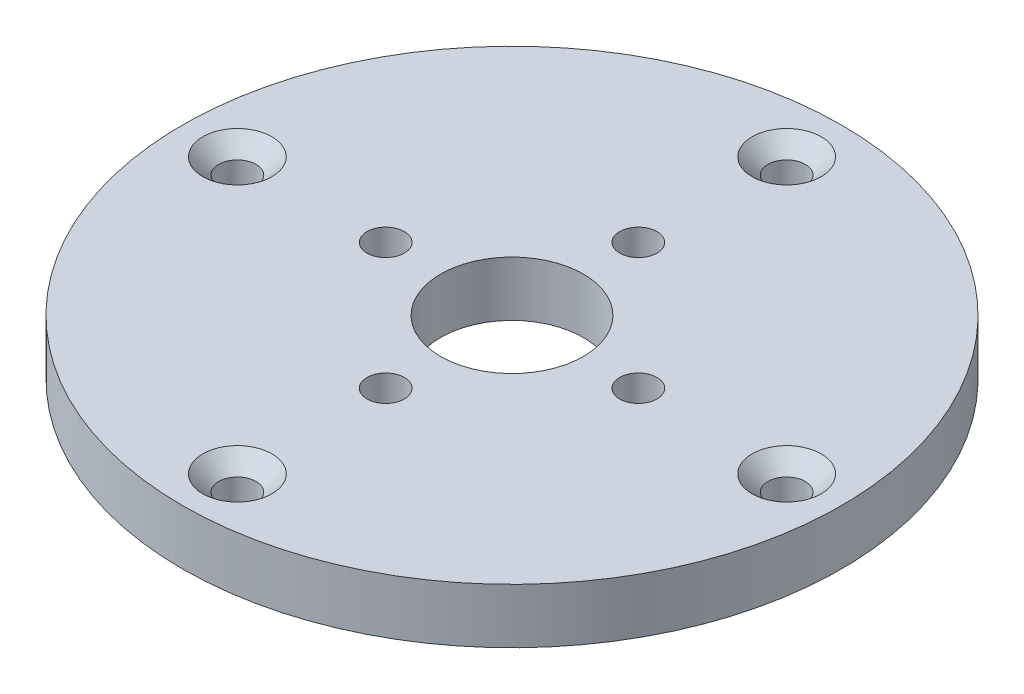
ISO-10303-21;
HEADER;
FILE_DESCRIPTION(('STEP AP214'),'2;1');
FILE_NAME('part.step','',(''),(''),'','','');
FILE_SCHEMA(('AUTOMOTIVE_DESIGN { 1 0 10303 214 1 1 1 1 }'));
ENDSEC;
DATA;
#1=APPLICATION_CONTEXT('core data for automotive mechanical design processes');
#2=APPLICATION_PROTOCOL_DEFINITION('international standard','automotive_design',2000,#1);
#3=PRODUCT_CONTEXT('',#1,'mechanical');
#4=PRODUCT('Part','Part','',(#3));
#5=PRODUCT_RELATED_PRODUCT_CATEGORY('part','',(#4));
#6=PRODUCT_DEFINITION_FORMATION('','',#4);
#7=PRODUCT_DEFINITION_CONTEXT('part definition',#1,'design');
#8=PRODUCT_DEFINITION('design','',#6,#7);
#9=PRODUCT_DEFINITION_SHAPE('','',#8);
#10=(LENGTH_UNIT() NAMED_UNIT(*) SI_UNIT(.MILLI.,.METRE.));
#11=(NAMED_UNIT(*) PLANE_ANGLE_UNIT() SI_UNIT($,.RADIAN.));
#12=(NAMED_UNIT(*) SI_UNIT($,.STERADIAN.) SOLID_ANGLE_UNIT());
#13=UNCERTAINTY_MEASURE_WITH_UNIT(LENGTH_MEASURE(1.E-05),#10,'distance_accuracy_value','');
#14=(GEOMETRIC_REPRESENTATION_CONTEXT(3) GLOBAL_UNCERTAINTY_ASSIGNED_CONTEXT((#13)) GLOBAL_UNIT_ASSIGNED_CONTEXT((#10,
#11,#12)) REPRESENTATION_CONTEXT('',''));
#15=CARTESIAN_POINT('',(0.,0.,0.));
#16=DIRECTION('',(0.,0.,1.));
#17=DIRECTION('',(1.,0.,0.));
#18=AXIS2_PLACEMENT_3D('',#15,#16,#17);
#19=CARTESIAN_POINT('',(0.,0.,0.));
#20=DIRECTION('',(0.,1.,0.));
#21=DIRECTION('',(0.,0.,1.));
#22=AXIS2_PLACEMENT_3D('',#19,#20,#21);
#23=PLANE('',#22);
#24=CARTESIAN_POINT('',(0.,0.,-25.));
#25=DIRECTION('',(0.,1.,0.));
#26=DIRECTION('',(0.,0.,1.));
#27=AXIS2_PLACEMENT_3D('',#24,#25,#26);
#28=CIRCLE('',#27,1.69999999999999);
#29=CARTESIAN_POINT('',(0.,0.,-23.3));
#30=VERTEX_POINT('',#29);
#31=EDGE_CURVE('E79',#30,#30,#28,.T.);
#32=ORIENTED_EDGE('',*,*,#31,.T.);
#33=EDGE_LOOP('',(#32));
#34=FACE_BOUND('',#33,.T.);
#35=CARTESIAN_POINT('',(-25.,0.,0.));
#36=DIRECTION('',(0.,1.,0.));
#37=DIRECTION('',(0.,0.,1.));
#38=AXIS2_PLACEMENT_3D('',#35,#36,#37);
#39=CIRCLE('',#38,1.69999999999999);
#40=CARTESIAN_POINT('',(-25.,0.,1.69999999999999));
#41=VERTEX_POINT('',#40);
#42=EDGE_CURVE('E70',#41,#41,#39,.T.);
#43=ORIENTED_EDGE('',*,*,#42,.T.);
#44=EDGE_LOOP('',(#43));
#45=FACE_BOUND('',#44,.T.);
#46=CARTESIAN_POINT('',(0.,0.,25.));
#47=DIRECTION('',(0.,1.,0.));
#48=DIRECTION('',(0.,0.,1.));
#49=AXIS2_PLACEMENT_3D('',#46,#47,#48);
#50=CIRCLE('',#49,1.69999999999999);
#51=CARTESIAN_POINT('',(0.,0.,26.7));
#52=VERTEX_POINT('',#51);
#53=EDGE_CURVE('E61',#52,#52,#50,.T.);
#54=ORIENTED_EDGE('',*,*,#53,.T.);
#55=EDGE_LOOP('',(#54));
#56=FACE_BOUND('',#55,.T.);
#57=CARTESIAN_POINT('',(25.,0.,0.));
#58=DIRECTION('',(0.,1.,0.));
#59=DIRECTION('',(0.,0.,1.));
#60=AXIS2_PLACEMENT_3D('',#57,#58,#59);
#61=CIRCLE('',#60,1.69999999999999);
#62=CARTESIAN_POINT('',(25.,0.,1.69999999999999));
#63=VERTEX_POINT('',#62);
#64=EDGE_CURVE('E50',#63,#63,#61,.T.);
#65=ORIENTED_EDGE('',*,*,#64,.T.);
#66=EDGE_LOOP('',(#65));
#67=FACE_BOUND('',#66,.T.);
#68=CARTESIAN_POINT('',(0.,0.,0.));
#69=DIRECTION('',(0.,1.,0.));
#70=DIRECTION('',(0.,0.,1.));
#71=AXIS2_PLACEMENT_3D('',#68,#69,#70);
#72=CIRCLE('',#71,30.);
#73=CARTESIAN_POINT('',(0.,0.,30.));
#74=VERTEX_POINT('',#73);
#75=EDGE_CURVE('E38',#74,#74,#72,.T.);
#76=ORIENTED_EDGE('',*,*,#75,.F.);
#77=EDGE_LOOP('',(#76));
#78=FACE_BOUND('',#77,.T.);
#79=CARTESIAN_POINT('',(0.,0.,0.));
#80=DIRECTION('',(0.,1.,0.));
#81=DIRECTION('',(0.,0.,1.));
#82=AXIS2_PLACEMENT_3D('',#79,#80,#81);
#83=CIRCLE('',#82,6.5);
#84=CARTESIAN_POINT('',(0.,0.,6.5));
#85=VERTEX_POINT('',#84);
#86=EDGE_CURVE('E47',#85,#85,#83,.T.);
#87=ORIENTED_EDGE('',*,*,#86,.T.);
#88=EDGE_LOOP('',(#87));
#89=FACE_BOUND('',#88,.T.);
#90=CARTESIAN_POINT('',(-11.5,0.,0.));
#91=DIRECTION('',(0.,-1.,0.));
#92=DIRECTION('',(0.,0.,-1.));
#93=AXIS2_PLACEMENT_3D('',#90,#91,#92);
#94=CIRCLE('',#93,3.15);
#95=CARTESIAN_POINT('',(-11.5,0.,-3.15));
#96=VERTEX_POINT('',#95);
#97=EDGE_CURVE('E94',#96,#96,#94,.T.);
#98=ORIENTED_EDGE('',*,*,#97,.F.);
#99=EDGE_LOOP('',(#98));
#100=FACE_BOUND('',#99,.T.);
#101=CARTESIAN_POINT('',(0.,0.,11.5));
#102=DIRECTION('',(0.,-1.,0.));
#103=DIRECTION('',(0.,0.,-1.));
#104=AXIS2_PLACEMENT_3D('',#101,#102,#103);
#105=CIRCLE('',#104,3.15);
#106=CARTESIAN_POINT('',(0.,0.,8.35));
#107=VERTEX_POINT('',#106);
#108=EDGE_CURVE('E103',#107,#107,#105,.T.);
#109=ORIENTED_EDGE('',*,*,#108,.F.);
#110=EDGE_LOOP('',(#109));
#111=FACE_BOUND('',#110,.T.);
#112=CARTESIAN_POINT('',(11.5,0.,0.));
#113=DIRECTION('',(0.,-1.,0.));
#114=DIRECTION('',(0.,0.,-1.));
#115=AXIS2_PLACEMENT_3D('',#112,#113,#114);
#116=CIRCLE('',#115,3.15);
#117=CARTESIAN_POINT('',(11.5,0.,-3.15));
#118=VERTEX_POINT('',#117);
#119=EDGE_CURVE('E112',#118,#118,#116,.T.);
#120=ORIENTED_EDGE('',*,*,#119,.F.);
#121=EDGE_LOOP('',(#120));
#122=FACE_BOUND('',#121,.T.);
#123=CARTESIAN_POINT('',(0.,0.,-11.5));
#124=DIRECTION('',(0.,-1.,0.));
#125=DIRECTION('',(0.,0.,-1.));
#126=AXIS2_PLACEMENT_3D('',#123,#124,#125);
#127=CIRCLE('',#126,3.15);
#128=CARTESIAN_POINT('',(0.,0.,-14.65));
#129=VERTEX_POINT('',#128);
#130=EDGE_CURVE('E121',#129,#129,#127,.T.);
#131=ORIENTED_EDGE('',*,*,#130,.F.);
#132=EDGE_LOOP('',(#131));
#133=FACE_BOUND('',#132,.T.);
#134=ADVANCED_FACE('F34',(#34,#45,#56,#67,#78,#89,#100,#111,#122,#133),#23,.F.);
#135=CARTESIAN_POINT('',(0.,5.,0.));
#136=DIRECTION('',(0.,1.,0.));
#137=DIRECTION('',(0.,0.,1.));
#138=AXIS2_PLACEMENT_3D('',#135,#136,#137);
#139=PLANE('',#138);
#140=CARTESIAN_POINT('',(0.,5.,-11.5));
#141=DIRECTION('',(0.,1.,0.));
#142=DIRECTION('',(0.,0.,1.));
#143=AXIS2_PLACEMENT_3D('',#140,#141,#142);
#144=CIRCLE('',#143,1.69999999999999);
#145=CARTESIAN_POINT('',(0.,5.,-9.80000000000001));
#146=VERTEX_POINT('',#145);
#147=EDGE_CURVE('E115',#146,#146,#144,.T.);
#148=ORIENTED_EDGE('',*,*,#147,.F.);
#149=EDGE_LOOP('',(#148));
#150=FACE_BOUND('',#149,.T.);
#151=CARTESIAN_POINT('',(11.5,5.,0.));
#152=DIRECTION('',(0.,1.,0.));
#153=DIRECTION('',(0.,0.,1.));
#154=AXIS2_PLACEMENT_3D('',#151,#152,#153);
#155=CIRCLE('',#154,1.69999999999999);
#156=CARTESIAN_POINT('',(11.5,5.,1.69999999999999));
#157=VERTEX_POINT('',#156);
#158=EDGE_CURVE('E106',#157,#157,#155,.T.);
#159=ORIENTED_EDGE('',*,*,#158,.F.);
#160=EDGE_LOOP('',(#159));
#161=FACE_BOUND('',#160,.T.);
#162=CARTESIAN_POINT('',(0.,5.,11.5));
#163=DIRECTION('',(0.,1.,0.));
#164=DIRECTION('',(0.,0.,1.));
#165=AXIS2_PLACEMENT_3D('',#162,#163,#164);
#166=CIRCLE('',#165,1.69999999999999);
#167=CARTESIAN_POINT('',(0.,5.,13.2));
#168=VERTEX_POINT('',#167);
#169=EDGE_CURVE('E97',#168,#168,#166,.T.);
#170=ORIENTED_EDGE('',*,*,#169,.F.);
#171=EDGE_LOOP('',(#170));
#172=FACE_BOUND('',#171,.T.);
#173=CARTESIAN_POINT('',(-11.5,5.,0.));
#174=DIRECTION('',(0.,1.,0.));
#175=DIRECTION('',(0.,0.,1.));
#176=AXIS2_PLACEMENT_3D('',#173,#174,#175);
#177=CIRCLE('',#176,1.69999999999999);
#178=CARTESIAN_POINT('',(-11.5,5.,1.69999999999999));
#179=VERTEX_POINT('',#178);
#180=EDGE_CURVE('E88',#179,#179,#177,.T.);
#181=ORIENTED_EDGE('',*,*,#180,.F.);
#182=EDGE_LOOP('',(#181));
#183=FACE_BOUND('',#182,.T.);
#184=CARTESIAN_POINT('',(0.,5.,-25.));
#185=DIRECTION('',(0.,1.,0.));
#186=DIRECTION('',(0.,0.,1.));
#187=AXIS2_PLACEMENT_3D('',#184,#185,#186);
#188=CIRCLE('',#187,3.15);
#189=CARTESIAN_POINT('',(0.,5.,-21.85));
#190=VERTEX_POINT('',#189);
#191=EDGE_CURVE('E85',#190,#190,#188,.T.);
#192=ORIENTED_EDGE('',*,*,#191,.F.);
#193=EDGE_LOOP('',(#192));
#194=FACE_BOUND('',#193,.T.);
#195=CARTESIAN_POINT('',(-25.,5.,0.));
#196=DIRECTION('',(0.,1.,0.));
#197=DIRECTION('',(0.,0.,1.));
#198=AXIS2_PLACEMENT_3D('',#195,#196,#197);
#199=CIRCLE('',#198,3.15);
#200=CARTESIAN_POINT('',(-25.,5.,3.15));
#201=VERTEX_POINT('',#200);
#202=EDGE_CURVE('E76',#201,#201,#199,.T.);
#203=ORIENTED_EDGE('',*,*,#202,.F.);
#204=EDGE_LOOP('',(#203));
#205=FACE_BOUND('',#204,.T.);
#206=CARTESIAN_POINT('',(0.,5.,25.));
#207=DIRECTION('',(0.,1.,0.));
#208=DIRECTION('',(0.,0.,1.));
#209=AXIS2_PLACEMENT_3D('',#206,#207,#208);
#210=CIRCLE('',#209,3.15);
#211=CARTESIAN_POINT('',(0.,5.,28.15));
#212=VERTEX_POINT('',#211);
#213=EDGE_CURVE('E67',#212,#212,#210,.T.);
#214=ORIENTED_EDGE('',*,*,#213,.F.);
#215=EDGE_LOOP('',(#214));
#216=FACE_BOUND('',#215,.T.);
#217=CARTESIAN_POINT('',(25.,5.,0.));
#218=DIRECTION('',(0.,1.,0.));
#219=DIRECTION('',(0.,0.,1.));
#220=AXIS2_PLACEMENT_3D('',#217,#218,#219);
#221=CIRCLE('',#220,3.15);
#222=CARTESIAN_POINT('',(25.,5.,3.15));
#223=VERTEX_POINT('',#222);
#224=EDGE_CURVE('E58',#223,#223,#221,.T.);
#225=ORIENTED_EDGE('',*,*,#224,.F.);
#226=EDGE_LOOP('',(#225));
#227=FACE_BOUND('',#226,.T.);
#228=CARTESIAN_POINT('',(0.,5.,0.));
#229=DIRECTION('',(0.,1.,0.));
#230=DIRECTION('',(0.,0.,1.));
#231=AXIS2_PLACEMENT_3D('',#228,#229,#230);
#232=CIRCLE('',#231,30.);
#233=CARTESIAN_POINT('',(0.,5.,30.));
#234=VERTEX_POINT('',#233);
#235=EDGE_CURVE('E10',#234,#234,#232,.T.);
#236=ORIENTED_EDGE('',*,*,#235,.T.);
#237=EDGE_LOOP('',(#236));
#238=FACE_BOUND('',#237,.T.);
#239=CARTESIAN_POINT('',(0.,5.,0.));
#240=DIRECTION('',(0.,1.,0.));
#241=DIRECTION('',(0.,0.,1.));
#242=AXIS2_PLACEMENT_3D('',#239,#240,#241);
#243=CIRCLE('',#242,6.5);
#244=CARTESIAN_POINT('',(0.,5.,6.5));
#245=VERTEX_POINT('',#244);
#246=EDGE_CURVE('E45',#245,#245,#243,.T.);
#247=ORIENTED_EDGE('',*,*,#246,.F.);
#248=EDGE_LOOP('',(#247));
#249=FACE_BOUND('',#248,.T.);
#250=ADVANCED_FACE('F128',(#150,#161,#172,#183,#194,#205,#216,#227,#238,#249),#139,.T.);
#251=CARTESIAN_POINT('',(0.,5.,0.));
#252=DIRECTION('',(0.,-1.,0.));
#253=DIRECTION('',(0.,0.,-1.));
#254=AXIS2_PLACEMENT_3D('',#251,#252,#253);
#255=CYLINDRICAL_SURFACE('',#254,30.);
#256=ORIENTED_EDGE('',*,*,#235,.F.);
#257=EDGE_LOOP('',(#256));
#258=FACE_BOUND('',#257,.T.);
#259=ORIENTED_EDGE('',*,*,#75,.T.);
#260=EDGE_LOOP('',(#259));
#261=FACE_BOUND('',#260,.T.);
#262=ADVANCED_FACE('F36',(#258,#261),#255,.T.);
#263=CARTESIAN_POINT('',(0.,5.,0.));
#264=DIRECTION('',(0.,-1.,0.));
#265=DIRECTION('',(0.,0.,-1.));
#266=AXIS2_PLACEMENT_3D('',#263,#264,#265);
#267=CYLINDRICAL_SURFACE('',#266,6.5);
#268=ORIENTED_EDGE('',*,*,#246,.T.);
#269=EDGE_LOOP('',(#268));
#270=FACE_BOUND('',#269,.T.);
#271=ORIENTED_EDGE('',*,*,#86,.F.);
#272=EDGE_LOOP('',(#271));
#273=FACE_BOUND('',#272,.T.);
#274=ADVANCED_FACE('F137',(#270,#273),#267,.F.);
#275=CARTESIAN_POINT('',(25.,5.,0.));
#276=DIRECTION('',(0.,1.,0.));
#277=DIRECTION('',(0.,0.,1.));
#278=AXIS2_PLACEMENT_3D('',#275,#276,#277);
#279=CYLINDRICAL_SURFACE('',#278,1.69999999999999);
#280=ORIENTED_EDGE('',*,*,#64,.F.);
#281=EDGE_LOOP('',(#280));
#282=FACE_BOUND('',#281,.T.);
#283=CARTESIAN_POINT('',(25.,3.54999999999999,0.));
#284=DIRECTION('',(0.,1.,0.));
#285=DIRECTION('',(0.,0.,1.));
#286=AXIS2_PLACEMENT_3D('',#283,#284,#285);
#287=CIRCLE('',#286,1.69999999999999);
#288=CARTESIAN_POINT('',(25.,3.54999999999999,1.69999999999999));
#289=VERTEX_POINT('',#288);
#290=EDGE_CURVE('E55',#289,#289,#287,.T.);
#291=ORIENTED_EDGE('',*,*,#290,.T.);
#292=EDGE_LOOP('',(#291));
#293=FACE_BOUND('',#292,.T.);
#294=ADVANCED_FACE('F140',(#282,#293),#279,.F.);
#295=CARTESIAN_POINT('',(25.,5.,0.));
#296=DIRECTION('',(0.,1.,0.));
#297=DIRECTION('',(0.,0.,1.));
#298=AXIS2_PLACEMENT_3D('',#295,#296,#297);
#299=CONICAL_SURFACE('',#298,3.15,0.785398163397449);
#300=ORIENTED_EDGE('',*,*,#290,.F.);
#301=EDGE_LOOP('',(#300));
#302=FACE_BOUND('',#301,.T.);
#303=ORIENTED_EDGE('',*,*,#224,.T.);
#304=EDGE_LOOP('',(#303));
#305=FACE_BOUND('',#304,.T.);
#306=ADVANCED_FACE('F144',(#302,#305),#299,.F.);
#307=CARTESIAN_POINT('',(0.,5.,25.));
#308=DIRECTION('',(0.,1.,0.));
#309=DIRECTION('',(0.,0.,1.));
#310=AXIS2_PLACEMENT_3D('',#307,#308,#309);
#311=CYLINDRICAL_SURFACE('',#310,1.69999999999999);
#312=ORIENTED_EDGE('',*,*,#53,.F.);
#313=EDGE_LOOP('',(#312));
#314=FACE_BOUND('',#313,.T.);
#315=CARTESIAN_POINT('',(0.,3.54999999999999,25.));
#316=DIRECTION('',(0.,1.,0.));
#317=DIRECTION('',(0.,0.,1.));
#318=AXIS2_PLACEMENT_3D('',#315,#316,#317);
#319=CIRCLE('',#318,1.69999999999999);
#320=CARTESIAN_POINT('',(0.,3.54999999999999,26.7));
#321=VERTEX_POINT('',#320);
#322=EDGE_CURVE('E64',#321,#321,#319,.T.);
#323=ORIENTED_EDGE('',*,*,#322,.T.);
#324=EDGE_LOOP('',(#323));
#325=FACE_BOUND('',#324,.T.);
#326=ADVANCED_FACE('F148',(#314,#325),#311,.F.);
#327=CARTESIAN_POINT('',(0.,5.,25.));
#328=DIRECTION('',(0.,1.,0.));
#329=DIRECTION('',(0.,0.,1.));
#330=AXIS2_PLACEMENT_3D('',#327,#328,#329);
#331=CONICAL_SURFACE('',#330,3.15,0.785398163397449);
#332=ORIENTED_EDGE('',*,*,#322,.F.);
#333=EDGE_LOOP('',(#332));
#334=FACE_BOUND('',#333,.T.);
#335=ORIENTED_EDGE('',*,*,#213,.T.);
#336=EDGE_LOOP('',(#335));
#337=FACE_BOUND('',#336,.T.);
#338=ADVANCED_FACE('F152',(#334,#337),#331,.F.);
#339=CARTESIAN_POINT('',(-25.,5.,0.));
#340=DIRECTION('',(0.,1.,0.));
#341=DIRECTION('',(0.,0.,1.));
#342=AXIS2_PLACEMENT_3D('',#339,#340,#341);
#343=CYLINDRICAL_SURFACE('',#342,1.69999999999999);
#344=ORIENTED_EDGE('',*,*,#42,.F.);
#345=EDGE_LOOP('',(#344));
#346=FACE_BOUND('',#345,.T.);
#347=CARTESIAN_POINT('',(-25.,3.54999999999999,0.));
#348=DIRECTION('',(0.,1.,0.));
#349=DIRECTION('',(0.,0.,1.));
#350=AXIS2_PLACEMENT_3D('',#347,#348,#349);
#351=CIRCLE('',#350,1.69999999999999);
#352=CARTESIAN_POINT('',(-25.,3.54999999999999,1.69999999999999));
#353=VERTEX_POINT('',#352);
#354=EDGE_CURVE('E73',#353,#353,#351,.T.);
#355=ORIENTED_EDGE('',*,*,#354,.T.);
#356=EDGE_LOOP('',(#355));
#357=FACE_BOUND('',#356,.T.);
#358=ADVANCED_FACE('F156',(#346,#357),#343,.F.);
#359=CARTESIAN_POINT('',(-25.,5.,0.));
#360=DIRECTION('',(0.,1.,0.));
#361=DIRECTION('',(0.,0.,1.));
#362=AXIS2_PLACEMENT_3D('',#359,#360,#361);
#363=CONICAL_SURFACE('',#362,3.15,0.785398163397449);
#364=ORIENTED_EDGE('',*,*,#354,.F.);
#365=EDGE_LOOP('',(#364));
#366=FACE_BOUND('',#365,.T.);
#367=ORIENTED_EDGE('',*,*,#202,.T.);
#368=EDGE_LOOP('',(#367));
#369=FACE_BOUND('',#368,.T.);
#370=ADVANCED_FACE('F160',(#366,#369),#363,.F.);
#371=CARTESIAN_POINT('',(0.,5.,-25.));
#372=DIRECTION('',(0.,1.,0.));
#373=DIRECTION('',(0.,0.,1.));
#374=AXIS2_PLACEMENT_3D('',#371,#372,#373);
#375=CYLINDRICAL_SURFACE('',#374,1.69999999999999);
#376=ORIENTED_EDGE('',*,*,#31,.F.);
#377=EDGE_LOOP('',(#376));
#378=FACE_BOUND('',#377,.T.);
#379=CARTESIAN_POINT('',(0.,3.54999999999999,-25.));
#380=DIRECTION('',(0.,1.,0.));
#381=DIRECTION('',(0.,0.,1.));
#382=AXIS2_PLACEMENT_3D('',#379,#380,#381);
#383=CIRCLE('',#382,1.69999999999999);
#384=CARTESIAN_POINT('',(0.,3.54999999999999,-23.3));
#385=VERTEX_POINT('',#384);
#386=EDGE_CURVE('E82',#385,#385,#383,.T.);
#387=ORIENTED_EDGE('',*,*,#386,.T.);
#388=EDGE_LOOP('',(#387));
#389=FACE_BOUND('',#388,.T.);
#390=ADVANCED_FACE('F164',(#378,#389),#375,.F.);
#391=CARTESIAN_POINT('',(0.,5.,-25.));
#392=DIRECTION('',(0.,1.,0.));
#393=DIRECTION('',(0.,0.,1.));
#394=AXIS2_PLACEMENT_3D('',#391,#392,#393);
#395=CONICAL_SURFACE('',#394,3.15,0.785398163397449);
#396=ORIENTED_EDGE('',*,*,#386,.F.);
#397=EDGE_LOOP('',(#396));
#398=FACE_BOUND('',#397,.T.);
#399=ORIENTED_EDGE('',*,*,#191,.T.);
#400=EDGE_LOOP('',(#399));
#401=FACE_BOUND('',#400,.T.);
#402=ADVANCED_FACE('F168',(#398,#401),#395,.F.);
#403=CARTESIAN_POINT('',(-11.5,0.,0.));
#404=DIRECTION('',(0.,-1.,0.));
#405=DIRECTION('',(0.,0.,-1.));
#406=AXIS2_PLACEMENT_3D('',#403,#404,#405);
#407=CYLINDRICAL_SURFACE('',#406,1.69999999999999);
#408=CARTESIAN_POINT('',(-11.5,1.45000000000001,0.));
#409=DIRECTION('',(0.,-1.,0.));
#410=DIRECTION('',(0.,0.,-1.));
#411=AXIS2_PLACEMENT_3D('',#408,#409,#410);
#412=CIRCLE('',#411,1.69999999999999);
#413=CARTESIAN_POINT('',(-11.5,1.45000000000001,-1.69999999999999));
#414=VERTEX_POINT('',#413);
#415=EDGE_CURVE('E91',#414,#414,#412,.T.);
#416=ORIENTED_EDGE('',*,*,#415,.T.);
#417=EDGE_LOOP('',(#416));
#418=FACE_BOUND('',#417,.T.);
#419=ORIENTED_EDGE('',*,*,#180,.T.);
#420=EDGE_LOOP('',(#419));
#421=FACE_BOUND('',#420,.T.);
#422=ADVANCED_FACE('F172',(#418,#421),#407,.F.);
#423=CARTESIAN_POINT('',(-11.5,0.,0.));
#424=DIRECTION('',(0.,-1.,0.));
#425=DIRECTION('',(0.,0.,-1.));
#426=AXIS2_PLACEMENT_3D('',#423,#424,#425);
#427=CONICAL_SURFACE('',#426,3.15,0.78539816339745);
#428=ORIENTED_EDGE('',*,*,#415,.F.);
#429=EDGE_LOOP('',(#428));
#430=FACE_BOUND('',#429,.T.);
#431=ORIENTED_EDGE('',*,*,#97,.T.);
#432=EDGE_LOOP('',(#431));
#433=FACE_BOUND('',#432,.T.);
#434=ADVANCED_FACE('F176',(#430,#433),#427,.F.);
#435=CARTESIAN_POINT('',(0.,0.,11.5));
#436=DIRECTION('',(0.,-1.,0.));
#437=DIRECTION('',(0.,0.,-1.));
#438=AXIS2_PLACEMENT_3D('',#435,#436,#437);
#439=CYLINDRICAL_SURFACE('',#438,1.69999999999999);
#440=CARTESIAN_POINT('',(0.,1.45000000000001,11.5));
#441=DIRECTION('',(0.,-1.,0.));
#442=DIRECTION('',(0.,0.,-1.));
#443=AXIS2_PLACEMENT_3D('',#440,#441,#442);
#444=CIRCLE('',#443,1.69999999999999);
#445=CARTESIAN_POINT('',(0.,1.45000000000001,9.80000000000001));
#446=VERTEX_POINT('',#445);
#447=EDGE_CURVE('E100',#446,#446,#444,.T.);
#448=ORIENTED_EDGE('',*,*,#447,.T.);
#449=EDGE_LOOP('',(#448));
#450=FACE_BOUND('',#449,.T.);
#451=ORIENTED_EDGE('',*,*,#169,.T.);
#452=EDGE_LOOP('',(#451));
#453=FACE_BOUND('',#452,.T.);
#454=ADVANCED_FACE('F180',(#450,#453),#439,.F.);
#455=CARTESIAN_POINT('',(0.,0.,11.5));
#456=DIRECTION('',(0.,-1.,0.));
#457=DIRECTION('',(0.,0.,-1.));
#458=AXIS2_PLACEMENT_3D('',#455,#456,#457);
#459=CONICAL_SURFACE('',#458,3.15,0.78539816339745);
#460=ORIENTED_EDGE('',*,*,#447,.F.);
#461=EDGE_LOOP('',(#460));
#462=FACE_BOUND('',#461,.T.);
#463=ORIENTED_EDGE('',*,*,#108,.T.);
#464=EDGE_LOOP('',(#463));
#465=FACE_BOUND('',#464,.T.);
#466=ADVANCED_FACE('F184',(#462,#465),#459,.F.);
#467=CARTESIAN_POINT('',(11.5,0.,0.));
#468=DIRECTION('',(0.,-1.,0.));
#469=DIRECTION('',(0.,0.,-1.));
#470=AXIS2_PLACEMENT_3D('',#467,#468,#469);
#471=CYLINDRICAL_SURFACE('',#470,1.69999999999999);
#472=CARTESIAN_POINT('',(11.5,1.45000000000001,0.));
#473=DIRECTION('',(0.,-1.,0.));
#474=DIRECTION('',(0.,0.,-1.));
#475=AXIS2_PLACEMENT_3D('',#472,#473,#474);
#476=CIRCLE('',#475,1.69999999999999);
#477=CARTESIAN_POINT('',(11.5,1.45000000000001,-1.69999999999999));
#478=VERTEX_POINT('',#477);
#479=EDGE_CURVE('E109',#478,#478,#476,.T.);
#480=ORIENTED_EDGE('',*,*,#479,.T.);
#481=EDGE_LOOP('',(#480));
#482=FACE_BOUND('',#481,.T.);
#483=ORIENTED_EDGE('',*,*,#158,.T.);
#484=EDGE_LOOP('',(#483));
#485=FACE_BOUND('',#484,.T.);
#486=ADVANCED_FACE('F188',(#482,#485),#471,.F.);
#487=CARTESIAN_POINT('',(11.5,0.,0.));
#488=DIRECTION('',(0.,-1.,0.));
#489=DIRECTION('',(0.,0.,-1.));
#490=AXIS2_PLACEMENT_3D('',#487,#488,#489);
#491=CONICAL_SURFACE('',#490,3.15,0.78539816339745);
#492=ORIENTED_EDGE('',*,*,#479,.F.);
#493=EDGE_LOOP('',(#492));
#494=FACE_BOUND('',#493,.T.);
#495=ORIENTED_EDGE('',*,*,#119,.T.);
#496=EDGE_LOOP('',(#495));
#497=FACE_BOUND('',#496,.T.);
#498=ADVANCED_FACE('F192',(#494,#497),#491,.F.);
#499=CARTESIAN_POINT('',(0.,0.,-11.5));
#500=DIRECTION('',(0.,-1.,0.));
#501=DIRECTION('',(0.,0.,-1.));
#502=AXIS2_PLACEMENT_3D('',#499,#500,#501);
#503=CYLINDRICAL_SURFACE('',#502,1.69999999999999);
#504=CARTESIAN_POINT('',(0.,1.45000000000001,-11.5));
#505=DIRECTION('',(0.,-1.,0.));
#506=DIRECTION('',(0.,0.,-1.));
#507=AXIS2_PLACEMENT_3D('',#504,#505,#506);
#508=CIRCLE('',#507,1.69999999999999);
#509=CARTESIAN_POINT('',(0.,1.45000000000001,-13.2));
#510=VERTEX_POINT('',#509);
#511=EDGE_CURVE('E118',#510,#510,#508,.T.);
#512=ORIENTED_EDGE('',*,*,#511,.T.);
#513=EDGE_LOOP('',(#512));
#514=FACE_BOUND('',#513,.T.);
#515=ORIENTED_EDGE('',*,*,#147,.T.);
#516=EDGE_LOOP('',(#515));
#517=FACE_BOUND('',#516,.T.);
#518=ADVANCED_FACE('F196',(#514,#517),#503,.F.);
#519=CARTESIAN_POINT('',(0.,0.,-11.5));
#520=DIRECTION('',(0.,-1.,0.));
#521=DIRECTION('',(0.,0.,-1.));
#522=AXIS2_PLACEMENT_3D('',#519,#520,#521);
#523=CONICAL_SURFACE('',#522,3.15,0.78539816339745);
#524=ORIENTED_EDGE('',*,*,#511,.F.);
#525=EDGE_LOOP('',(#524));
#526=FACE_BOUND('',#525,.T.);
#527=ORIENTED_EDGE('',*,*,#130,.T.);
#528=EDGE_LOOP('',(#527));
#529=FACE_BOUND('',#528,.T.);
#530=ADVANCED_FACE('F125',(#526,#529),#523,.F.);
#531=CLOSED_SHELL('',(#134,#250,#262,#274,#294,#306,#326,#338,#358,#370,#390,#402,#422,#434,
#454,#466,#486,#498,#518,#530));
#532=MANIFOLD_SOLID_BREP('B2',#531);
#533=ADVANCED_BREP_SHAPE_REPRESENTATION('',(#18,#532),#14);
#534=SHAPE_DEFINITION_REPRESENTATION(#9,#533);
ENDSEC;
END-ISO-10303-21;
